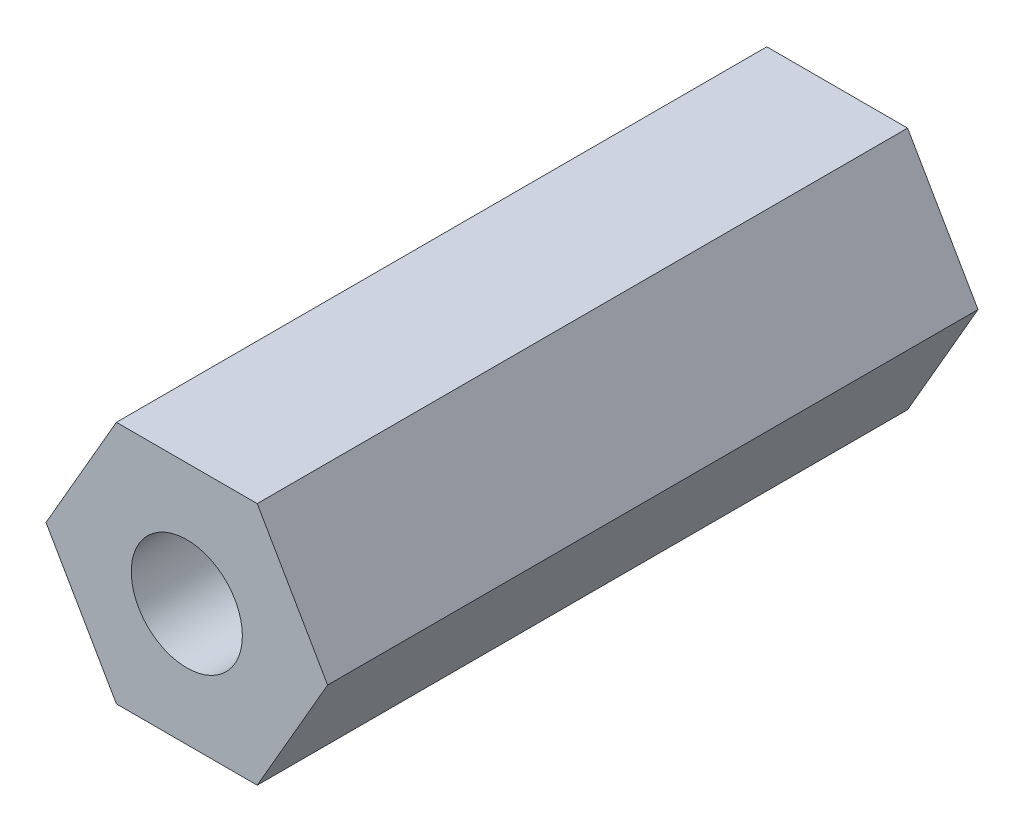
ISO-10303-21;
HEADER;
FILE_DESCRIPTION(('STEP AP214'),'2;1');
FILE_NAME('part.step','',(''),(''),'','','');
FILE_SCHEMA(('AUTOMOTIVE_DESIGN { 1 0 10303 214 1 1 1 1 }'));
ENDSEC;
DATA;
#1=APPLICATION_CONTEXT('core data for automotive mechanical design processes');
#2=APPLICATION_PROTOCOL_DEFINITION('international standard','automotive_design',2000,#1);
#3=PRODUCT_CONTEXT('',#1,'mechanical');
#4=PRODUCT('Part','Part','',(#3));
#5=PRODUCT_RELATED_PRODUCT_CATEGORY('part','',(#4));
#6=PRODUCT_DEFINITION_FORMATION('','',#4);
#7=PRODUCT_DEFINITION_CONTEXT('part definition',#1,'design');
#8=PRODUCT_DEFINITION('design','',#6,#7);
#9=PRODUCT_DEFINITION_SHAPE('','',#8);
#10=(LENGTH_UNIT() NAMED_UNIT(*) SI_UNIT(.MILLI.,.METRE.));
#11=(NAMED_UNIT(*) PLANE_ANGLE_UNIT() SI_UNIT($,.RADIAN.));
#12=(NAMED_UNIT(*) SI_UNIT($,.STERADIAN.) SOLID_ANGLE_UNIT());
#13=UNCERTAINTY_MEASURE_WITH_UNIT(LENGTH_MEASURE(1.E-05),#10,'distance_accuracy_value','');
#14=(GEOMETRIC_REPRESENTATION_CONTEXT(3) GLOBAL_UNCERTAINTY_ASSIGNED_CONTEXT((#13)) GLOBAL_UNIT_ASSIGNED_CONTEXT((#10,
#11,#12)) REPRESENTATION_CONTEXT('',''));
#15=CARTESIAN_POINT('',(0.,0.,0.));
#16=DIRECTION('',(0.,0.,1.));
#17=DIRECTION('',(1.,0.,0.));
#18=AXIS2_PLACEMENT_3D('',#15,#16,#17);
#19=CARTESIAN_POINT('',(1.29903810567666,2.25,12.));
#20=DIRECTION('',(0.,-1.,0.));
#21=DIRECTION('',(0.,0.,-1.));
#22=AXIS2_PLACEMENT_3D('',#19,#20,#21);
#23=PLANE('',#22);
#24=DIRECTION('',(-1.,0.,0.));
#25=VECTOR('',#24,1.);
#26=CARTESIAN_POINT('',(1.29903810567666,2.25,0.));
#27=LINE('',#26,#25);
#28=CARTESIAN_POINT('',(1.29903810567666,2.25,0.));
#29=VERTEX_POINT('',#28);
#30=CARTESIAN_POINT('',(-1.29903810567666,2.25,0.));
#31=VERTEX_POINT('',#30);
#32=EDGE_CURVE('E122',#29,#31,#27,.T.);
#33=ORIENTED_EDGE('',*,*,#32,.T.);
#34=DIRECTION('',(0.,0.,-1.));
#35=VECTOR('',#34,1.);
#36=CARTESIAN_POINT('',(-1.29903810567666,2.25,12.));
#37=LINE('',#36,#35);
#38=CARTESIAN_POINT('',(-1.29903810567666,2.25,12.));
#39=VERTEX_POINT('',#38);
#40=EDGE_CURVE('E11',#39,#31,#37,.T.);
#41=ORIENTED_EDGE('',*,*,#40,.F.);
#42=DIRECTION('',(-1.,0.,0.));
#43=VECTOR('',#42,1.);
#44=CARTESIAN_POINT('',(1.29903810567666,2.25,12.));
#45=LINE('',#44,#43);
#46=CARTESIAN_POINT('',(1.29903810567666,2.25,12.));
#47=VERTEX_POINT('',#46);
#48=EDGE_CURVE('E132',#47,#39,#45,.T.);
#49=ORIENTED_EDGE('',*,*,#48,.F.);
#50=DIRECTION('',(0.,0.,-1.));
#51=VECTOR('',#50,1.);
#52=CARTESIAN_POINT('',(1.29903810567666,2.25,12.));
#53=LINE('',#52,#51);
#54=EDGE_CURVE('E118',#47,#29,#53,.T.);
#55=ORIENTED_EDGE('',*,*,#54,.T.);
#56=EDGE_LOOP('',(#33,#41,#49,#55));
#57=FACE_BOUND('',#56,.T.);
#58=ADVANCED_FACE('F37',(#57),#23,.F.);
#59=CARTESIAN_POINT('',(-1.29903810567666,2.25,12.));
#60=DIRECTION('',(0.866025403784439,-0.5,0.));
#61=DIRECTION('',(0.5,0.866025403784439,0.));
#62=AXIS2_PLACEMENT_3D('',#59,#60,#61);
#63=PLANE('',#62);
#64=DIRECTION('',(-0.5,-0.866025403784439,0.));
#65=VECTOR('',#64,1.);
#66=CARTESIAN_POINT('',(-1.29903810567666,2.25,0.));
#67=LINE('',#66,#65);
#68=CARTESIAN_POINT('',(-2.59807621135331,0.,0.));
#69=VERTEX_POINT('',#68);
#70=EDGE_CURVE('E125',#31,#69,#67,.T.);
#71=ORIENTED_EDGE('',*,*,#70,.T.);
#72=DIRECTION('',(0.,0.,-1.));
#73=VECTOR('',#72,1.);
#74=CARTESIAN_POINT('',(-2.59807621135331,0.,12.));
#75=LINE('',#74,#73);
#76=CARTESIAN_POINT('',(-2.59807621135331,0.,12.));
#77=VERTEX_POINT('',#76);
#78=EDGE_CURVE('E46',#77,#69,#75,.T.);
#79=ORIENTED_EDGE('',*,*,#78,.F.);
#80=DIRECTION('',(-0.5,-0.866025403784439,0.));
#81=VECTOR('',#80,1.);
#82=CARTESIAN_POINT('',(-1.29903810567666,2.25,12.));
#83=LINE('',#82,#81);
#84=EDGE_CURVE('E91',#39,#77,#83,.T.);
#85=ORIENTED_EDGE('',*,*,#84,.F.);
#86=ORIENTED_EDGE('',*,*,#40,.T.);
#87=EDGE_LOOP('',(#71,#79,#85,#86));
#88=FACE_BOUND('',#87,.T.);
#89=ADVANCED_FACE('F158',(#88),#63,.F.);
#90=CARTESIAN_POINT('',(-2.59807621135331,0.,12.));
#91=DIRECTION('',(0.866025403784438,0.5,0.));
#92=DIRECTION('',(-0.5,0.866025403784439,0.));
#93=AXIS2_PLACEMENT_3D('',#90,#91,#92);
#94=PLANE('',#93);
#95=DIRECTION('',(0.5,-0.866025403784439,0.));
#96=VECTOR('',#95,1.);
#97=CARTESIAN_POINT('',(-2.59807621135331,0.,0.));
#98=LINE('',#97,#96);
#99=CARTESIAN_POINT('',(-1.29903810567666,-2.25,0.));
#100=VERTEX_POINT('',#99);
#101=EDGE_CURVE('E127',#69,#100,#98,.T.);
#102=ORIENTED_EDGE('',*,*,#101,.T.);
#103=DIRECTION('',(0.,0.,-1.));
#104=VECTOR('',#103,1.);
#105=CARTESIAN_POINT('',(-1.29903810567666,-2.25,12.));
#106=LINE('',#105,#104);
#107=CARTESIAN_POINT('',(-1.29903810567666,-2.25,12.));
#108=VERTEX_POINT('',#107);
#109=EDGE_CURVE('E113',#108,#100,#106,.T.);
#110=ORIENTED_EDGE('',*,*,#109,.F.);
#111=DIRECTION('',(0.5,-0.866025403784439,0.));
#112=VECTOR('',#111,1.);
#113=CARTESIAN_POINT('',(-2.59807621135331,0.,12.));
#114=LINE('',#113,#112);
#115=EDGE_CURVE('E104',#77,#108,#114,.T.);
#116=ORIENTED_EDGE('',*,*,#115,.F.);
#117=ORIENTED_EDGE('',*,*,#78,.T.);
#118=EDGE_LOOP('',(#102,#110,#116,#117));
#119=FACE_BOUND('',#118,.T.);
#120=ADVANCED_FACE('F139',(#119),#94,.F.);
#121=CARTESIAN_POINT('',(-1.29903810567666,-2.25,12.));
#122=DIRECTION('',(0.,1.,0.));
#123=DIRECTION('',(-1.,0.,0.));
#124=AXIS2_PLACEMENT_3D('',#121,#122,#123);
#125=PLANE('',#124);
#126=DIRECTION('',(1.,0.,0.));
#127=VECTOR('',#126,1.);
#128=CARTESIAN_POINT('',(-1.29903810567666,-2.25,0.));
#129=LINE('',#128,#127);
#130=CARTESIAN_POINT('',(1.29903810567666,-2.25,0.));
#131=VERTEX_POINT('',#130);
#132=EDGE_CURVE('E112',#100,#131,#129,.T.);
#133=ORIENTED_EDGE('',*,*,#132,.T.);
#134=DIRECTION('',(0.,0.,-1.));
#135=VECTOR('',#134,1.);
#136=CARTESIAN_POINT('',(1.29903810567666,-2.25,12.));
#137=LINE('',#136,#135);
#138=CARTESIAN_POINT('',(1.29903810567666,-2.25,12.));
#139=VERTEX_POINT('',#138);
#140=EDGE_CURVE('E109',#139,#131,#137,.T.);
#141=ORIENTED_EDGE('',*,*,#140,.F.);
#142=DIRECTION('',(1.,0.,0.));
#143=VECTOR('',#142,1.);
#144=CARTESIAN_POINT('',(-1.29903810567666,-2.25,12.));
#145=LINE('',#144,#143);
#146=EDGE_CURVE('E98',#108,#139,#145,.T.);
#147=ORIENTED_EDGE('',*,*,#146,.F.);
#148=ORIENTED_EDGE('',*,*,#109,.T.);
#149=EDGE_LOOP('',(#133,#141,#147,#148));
#150=FACE_BOUND('',#149,.T.);
#151=ADVANCED_FACE('F110',(#150),#125,.F.);
#152=CARTESIAN_POINT('',(1.29903810567666,-2.25,12.));
#153=DIRECTION('',(-0.866025403784439,0.5,0.));
#154=DIRECTION('',(-0.5,-0.866025403784439,0.));
#155=AXIS2_PLACEMENT_3D('',#152,#153,#154);
#156=PLANE('',#155);
#157=DIRECTION('',(0.5,0.866025403784439,0.));
#158=VECTOR('',#157,1.);
#159=CARTESIAN_POINT('',(1.29903810567666,-2.25,0.));
#160=LINE('',#159,#158);
#161=CARTESIAN_POINT('',(2.59807621135332,0.,0.));
#162=VERTEX_POINT('',#161);
#163=EDGE_CURVE('E77',#131,#162,#160,.T.);
#164=ORIENTED_EDGE('',*,*,#163,.T.);
#165=DIRECTION('',(0.,0.,-1.));
#166=VECTOR('',#165,1.);
#167=CARTESIAN_POINT('',(2.59807621135332,0.,12.));
#168=LINE('',#167,#166);
#169=CARTESIAN_POINT('',(2.59807621135332,0.,12.));
#170=VERTEX_POINT('',#169);
#171=EDGE_CURVE('E114',#170,#162,#168,.T.);
#172=ORIENTED_EDGE('',*,*,#171,.F.);
#173=DIRECTION('',(0.5,0.866025403784439,0.));
#174=VECTOR('',#173,1.);
#175=CARTESIAN_POINT('',(1.29903810567666,-2.25,12.));
#176=LINE('',#175,#174);
#177=EDGE_CURVE('E102',#139,#170,#176,.T.);
#178=ORIENTED_EDGE('',*,*,#177,.F.);
#179=ORIENTED_EDGE('',*,*,#140,.T.);
#180=EDGE_LOOP('',(#164,#172,#178,#179));
#181=FACE_BOUND('',#180,.T.);
#182=ADVANCED_FACE('F116',(#181),#156,.F.);
#183=CARTESIAN_POINT('',(2.59807621135332,0.,12.));
#184=DIRECTION('',(-0.866025403784439,-0.5,0.));
#185=DIRECTION('',(0.5,-0.866025403784439,0.));
#186=AXIS2_PLACEMENT_3D('',#183,#184,#185);
#187=PLANE('',#186);
#188=DIRECTION('',(-0.5,0.866025403784438,0.));
#189=VECTOR('',#188,1.);
#190=CARTESIAN_POINT('',(2.59807621135332,0.,0.));
#191=LINE('',#190,#189);
#192=EDGE_CURVE('E83',#162,#29,#191,.T.);
#193=ORIENTED_EDGE('',*,*,#192,.T.);
#194=ORIENTED_EDGE('',*,*,#54,.F.);
#195=DIRECTION('',(-0.5,0.866025403784438,0.));
#196=VECTOR('',#195,1.);
#197=CARTESIAN_POINT('',(2.59807621135332,0.,12.));
#198=LINE('',#197,#196);
#199=EDGE_CURVE('E54',#170,#47,#198,.T.);
#200=ORIENTED_EDGE('',*,*,#199,.F.);
#201=ORIENTED_EDGE('',*,*,#171,.T.);
#202=EDGE_LOOP('',(#193,#194,#200,#201));
#203=FACE_BOUND('',#202,.T.);
#204=ADVANCED_FACE('F146',(#203),#187,.F.);
#205=CARTESIAN_POINT('',(0.,0.,12.));
#206=DIRECTION('',(0.,0.,1.));
#207=DIRECTION('',(1.,0.,0.));
#208=AXIS2_PLACEMENT_3D('',#205,#206,#207);
#209=PLANE('',#208);
#210=CARTESIAN_POINT('',(0.,0.,12.));
#211=DIRECTION('',(0.,0.,1.));
#212=DIRECTION('',(1.,0.,0.));
#213=AXIS2_PLACEMENT_3D('',#210,#211,#212);
#214=CIRCLE('',#213,1.025);
#215=CARTESIAN_POINT('',(1.025,0.,12.));
#216=VERTEX_POINT('',#215);
#217=EDGE_CURVE('E213',#216,#216,#214,.T.);
#218=ORIENTED_EDGE('',*,*,#217,.F.);
#219=EDGE_LOOP('',(#218));
#220=FACE_BOUND('',#219,.T.);
#221=ORIENTED_EDGE('',*,*,#48,.T.);
#222=ORIENTED_EDGE('',*,*,#84,.T.);
#223=ORIENTED_EDGE('',*,*,#115,.T.);
#224=ORIENTED_EDGE('',*,*,#146,.T.);
#225=ORIENTED_EDGE('',*,*,#177,.T.);
#226=ORIENTED_EDGE('',*,*,#199,.T.);
#227=EDGE_LOOP('',(#221,#222,#223,#224,#225,#226));
#228=FACE_BOUND('',#227,.T.);
#229=ADVANCED_FACE('F100',(#220,#228),#209,.T.);
#230=CARTESIAN_POINT('',(0.,0.,0.));
#231=DIRECTION('',(0.,0.,1.));
#232=DIRECTION('',(1.,0.,0.));
#233=AXIS2_PLACEMENT_3D('',#230,#231,#232);
#234=PLANE('',#233);
#235=CARTESIAN_POINT('',(0.,0.,0.));
#236=DIRECTION('',(0.,0.,1.));
#237=DIRECTION('',(1.,0.,0.));
#238=AXIS2_PLACEMENT_3D('',#235,#236,#237);
#239=CIRCLE('',#238,1.025);
#240=CARTESIAN_POINT('',(1.025,0.,0.));
#241=VERTEX_POINT('',#240);
#242=EDGE_CURVE('E40',#241,#241,#239,.T.);
#243=ORIENTED_EDGE('',*,*,#242,.T.);
#244=EDGE_LOOP('',(#243));
#245=FACE_BOUND('',#244,.T.);
#246=ORIENTED_EDGE('',*,*,#32,.F.);
#247=ORIENTED_EDGE('',*,*,#192,.F.);
#248=ORIENTED_EDGE('',*,*,#163,.F.);
#249=ORIENTED_EDGE('',*,*,#132,.F.);
#250=ORIENTED_EDGE('',*,*,#101,.F.);
#251=ORIENTED_EDGE('',*,*,#70,.F.);
#252=EDGE_LOOP('',(#246,#247,#248,#249,#250,#251));
#253=FACE_BOUND('',#252,.T.);
#254=ADVANCED_FACE('F142',(#245,#253),#234,.F.);
#255=CARTESIAN_POINT('',(0.,0.,12.));
#256=DIRECTION('',(0.,0.,1.));
#257=DIRECTION('',(1.,0.,0.));
#258=AXIS2_PLACEMENT_3D('',#255,#256,#257);
#259=CYLINDRICAL_SURFACE('',#258,1.025);
#260=ORIENTED_EDGE('',*,*,#217,.T.);
#261=EDGE_LOOP('',(#260));
#262=FACE_BOUND('',#261,.T.);
#263=ORIENTED_EDGE('',*,*,#242,.F.);
#264=EDGE_LOOP('',(#263));
#265=FACE_BOUND('',#264,.T.);
#266=ADVANCED_FACE('F195',(#262,#265),#259,.F.);
#267=CLOSED_SHELL('',(#58,#89,#120,#151,#182,#204,#229,#254,#266));
#268=MANIFOLD_SOLID_BREP('B2',#267);
#269=ADVANCED_BREP_SHAPE_REPRESENTATION('',(#18,#268),#14);
#270=SHAPE_DEFINITION_REPRESENTATION(#9,#269);
ENDSEC;
END-ISO-10303-21;
